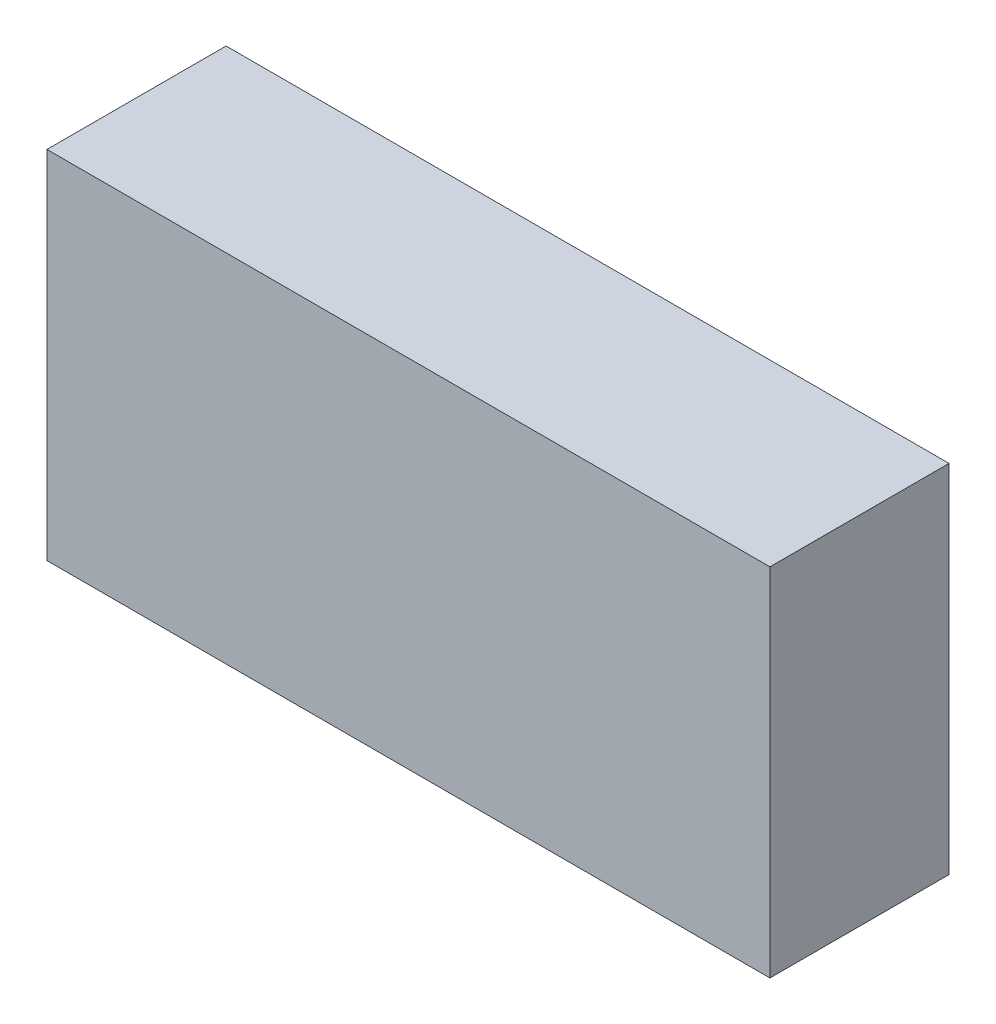
ISO-10303-21;
HEADER;
FILE_DESCRIPTION(('STEP AP214'),'2;1');
FILE_NAME('part.step','',(''),(''),'','','');
FILE_SCHEMA(('AUTOMOTIVE_DESIGN { 1 0 10303 214 1 1 1 1 }'));
ENDSEC;
DATA;
#1=APPLICATION_CONTEXT('core data for automotive mechanical design processes');
#2=APPLICATION_PROTOCOL_DEFINITION('international standard','automotive_design',2000,#1);
#3=PRODUCT_CONTEXT('',#1,'mechanical');
#4=PRODUCT('Part','Part','',(#3));
#5=PRODUCT_RELATED_PRODUCT_CATEGORY('part','',(#4));
#6=PRODUCT_DEFINITION_FORMATION('','',#4);
#7=PRODUCT_DEFINITION_CONTEXT('part definition',#1,'design');
#8=PRODUCT_DEFINITION('design','',#6,#7);
#9=PRODUCT_DEFINITION_SHAPE('','',#8);
#10=(LENGTH_UNIT() NAMED_UNIT(*) SI_UNIT(.MILLI.,.METRE.));
#11=(NAMED_UNIT(*) PLANE_ANGLE_UNIT() SI_UNIT($,.RADIAN.));
#12=(NAMED_UNIT(*) SI_UNIT($,.STERADIAN.) SOLID_ANGLE_UNIT());
#13=UNCERTAINTY_MEASURE_WITH_UNIT(LENGTH_MEASURE(1.E-05),#10,'distance_accuracy_value','');
#14=(GEOMETRIC_REPRESENTATION_CONTEXT(3) GLOBAL_UNCERTAINTY_ASSIGNED_CONTEXT((#13)) GLOBAL_UNIT_ASSIGNED_CONTEXT((#10,
#11,#12)) REPRESENTATION_CONTEXT('',''));
#15=CARTESIAN_POINT('',(0.,0.,0.));
#16=DIRECTION('',(0.,0.,1.));
#17=DIRECTION('',(1.,0.,0.));
#18=AXIS2_PLACEMENT_3D('',#15,#16,#17);
#19=CARTESIAN_POINT('',(0.,0.,21.082));
#20=DIRECTION('',(1.,0.,0.));
#21=DIRECTION('',(0.,0.,-1.));
#22=AXIS2_PLACEMENT_3D('',#19,#20,#21);
#23=PLANE('',#22);
#24=DIRECTION('',(0.,-1.,0.));
#25=VECTOR('',#24,1.);
#26=CARTESIAN_POINT('',(0.,0.,0.));
#27=LINE('',#26,#25);
#28=CARTESIAN_POINT('',(0.,41.91,0.));
#29=VERTEX_POINT('',#28);
#30=CARTESIAN_POINT('',(0.,0.,0.));
#31=VERTEX_POINT('',#30);
#32=EDGE_CURVE('E97',#29,#31,#27,.T.);
#33=ORIENTED_EDGE('',*,*,#32,.T.);
#34=DIRECTION('',(0.,0.,-1.));
#35=VECTOR('',#34,1.);
#36=CARTESIAN_POINT('',(0.,0.,21.082));
#37=LINE('',#36,#35);
#38=CARTESIAN_POINT('',(0.,0.,21.082));
#39=VERTEX_POINT('',#38);
#40=EDGE_CURVE('E11',#39,#31,#37,.T.);
#41=ORIENTED_EDGE('',*,*,#40,.F.);
#42=DIRECTION('',(0.,-1.,0.));
#43=VECTOR('',#42,1.);
#44=CARTESIAN_POINT('',(0.,0.,21.082));
#45=LINE('',#44,#43);
#46=CARTESIAN_POINT('',(0.,41.91,21.082));
#47=VERTEX_POINT('',#46);
#48=EDGE_CURVE('E85',#47,#39,#45,.T.);
#49=ORIENTED_EDGE('',*,*,#48,.F.);
#50=DIRECTION('',(0.,0.,-1.));
#51=VECTOR('',#50,1.);
#52=CARTESIAN_POINT('',(0.,41.91,21.082));
#53=LINE('',#52,#51);
#54=EDGE_CURVE('E93',#47,#29,#53,.T.);
#55=ORIENTED_EDGE('',*,*,#54,.T.);
#56=EDGE_LOOP('',(#33,#41,#49,#55));
#57=FACE_BOUND('',#56,.T.);
#58=ADVANCED_FACE('F34',(#57),#23,.F.);
#59=CARTESIAN_POINT('',(0.,0.,21.082));
#60=DIRECTION('',(0.,1.,0.));
#61=DIRECTION('',(0.,0.,1.));
#62=AXIS2_PLACEMENT_3D('',#59,#60,#61);
#63=PLANE('',#62);
#64=DIRECTION('',(1.,0.,0.));
#65=VECTOR('',#64,1.);
#66=CARTESIAN_POINT('',(0.,0.,0.));
#67=LINE('',#66,#65);
#68=CARTESIAN_POINT('',(85.09,0.,0.));
#69=VERTEX_POINT('',#68);
#70=EDGE_CURVE('E89',#31,#69,#67,.T.);
#71=ORIENTED_EDGE('',*,*,#70,.T.);
#72=DIRECTION('',(0.,0.,-1.));
#73=VECTOR('',#72,1.);
#74=CARTESIAN_POINT('',(85.09,0.,21.082));
#75=LINE('',#74,#73);
#76=CARTESIAN_POINT('',(85.09,0.,21.082));
#77=VERTEX_POINT('',#76);
#78=EDGE_CURVE('E42',#77,#69,#75,.T.);
#79=ORIENTED_EDGE('',*,*,#78,.F.);
#80=DIRECTION('',(1.,0.,0.));
#81=VECTOR('',#80,1.);
#82=CARTESIAN_POINT('',(0.,0.,21.082));
#83=LINE('',#82,#81);
#84=EDGE_CURVE('E80',#39,#77,#83,.T.);
#85=ORIENTED_EDGE('',*,*,#84,.F.);
#86=ORIENTED_EDGE('',*,*,#40,.T.);
#87=EDGE_LOOP('',(#71,#79,#85,#86));
#88=FACE_BOUND('',#87,.T.);
#89=ADVANCED_FACE('F88',(#88),#63,.F.);
#90=CARTESIAN_POINT('',(85.09,0.,21.082));
#91=DIRECTION('',(-1.,0.,0.));
#92=DIRECTION('',(0.,0.,1.));
#93=AXIS2_PLACEMENT_3D('',#90,#91,#92);
#94=PLANE('',#93);
#95=DIRECTION('',(0.,1.,0.));
#96=VECTOR('',#95,1.);
#97=CARTESIAN_POINT('',(85.09,0.,0.));
#98=LINE('',#97,#96);
#99=CARTESIAN_POINT('',(85.09,41.91,0.));
#100=VERTEX_POINT('',#99);
#101=EDGE_CURVE('E67',#69,#100,#98,.T.);
#102=ORIENTED_EDGE('',*,*,#101,.T.);
#103=DIRECTION('',(0.,0.,-1.));
#104=VECTOR('',#103,1.);
#105=CARTESIAN_POINT('',(85.09,41.91,21.082));
#106=LINE('',#105,#104);
#107=CARTESIAN_POINT('',(85.09,41.91,21.082));
#108=VERTEX_POINT('',#107);
#109=EDGE_CURVE('E90',#108,#100,#106,.T.);
#110=ORIENTED_EDGE('',*,*,#109,.F.);
#111=DIRECTION('',(0.,1.,0.));
#112=VECTOR('',#111,1.);
#113=CARTESIAN_POINT('',(85.09,0.,21.082));
#114=LINE('',#113,#112);
#115=EDGE_CURVE('E83',#77,#108,#114,.T.);
#116=ORIENTED_EDGE('',*,*,#115,.F.);
#117=ORIENTED_EDGE('',*,*,#78,.T.);
#118=EDGE_LOOP('',(#102,#110,#116,#117));
#119=FACE_BOUND('',#118,.T.);
#120=ADVANCED_FACE('F91',(#119),#94,.F.);
#121=CARTESIAN_POINT('',(0.,41.91,21.082));
#122=DIRECTION('',(0.,-1.,0.));
#123=DIRECTION('',(0.,0.,-1.));
#124=AXIS2_PLACEMENT_3D('',#121,#122,#123);
#125=PLANE('',#124);
#126=DIRECTION('',(-1.,0.,0.));
#127=VECTOR('',#126,1.);
#128=CARTESIAN_POINT('',(0.,41.91,0.));
#129=LINE('',#128,#127);
#130=EDGE_CURVE('E73',#100,#29,#129,.T.);
#131=ORIENTED_EDGE('',*,*,#130,.T.);
#132=ORIENTED_EDGE('',*,*,#54,.F.);
#133=DIRECTION('',(-1.,0.,0.));
#134=VECTOR('',#133,1.);
#135=CARTESIAN_POINT('',(0.,41.91,21.082));
#136=LINE('',#135,#134);
#137=EDGE_CURVE('E50',#108,#47,#136,.T.);
#138=ORIENTED_EDGE('',*,*,#137,.F.);
#139=ORIENTED_EDGE('',*,*,#109,.T.);
#140=EDGE_LOOP('',(#131,#132,#138,#139));
#141=FACE_BOUND('',#140,.T.);
#142=ADVANCED_FACE('F104',(#141),#125,.F.);
#143=CARTESIAN_POINT('',(0.,0.,21.082));
#144=DIRECTION('',(0.,0.,-1.));
#145=DIRECTION('',(-1.,0.,0.));
#146=AXIS2_PLACEMENT_3D('',#143,#144,#145);
#147=PLANE('',#146);
#148=ORIENTED_EDGE('',*,*,#48,.T.);
#149=ORIENTED_EDGE('',*,*,#84,.T.);
#150=ORIENTED_EDGE('',*,*,#115,.T.);
#151=ORIENTED_EDGE('',*,*,#137,.T.);
#152=EDGE_LOOP('',(#148,#149,#150,#151));
#153=FACE_BOUND('',#152,.T.);
#154=ADVANCED_FACE('F81',(#153),#147,.F.);
#155=CARTESIAN_POINT('',(0.,0.,0.));
#156=DIRECTION('',(0.,0.,-1.));
#157=DIRECTION('',(-1.,0.,0.));
#158=AXIS2_PLACEMENT_3D('',#155,#156,#157);
#159=PLANE('',#158);
#160=ORIENTED_EDGE('',*,*,#32,.F.);
#161=ORIENTED_EDGE('',*,*,#130,.F.);
#162=ORIENTED_EDGE('',*,*,#101,.F.);
#163=ORIENTED_EDGE('',*,*,#70,.F.);
#164=EDGE_LOOP('',(#160,#161,#162,#163));
#165=FACE_BOUND('',#164,.T.);
#166=ADVANCED_FACE('F107',(#165),#159,.T.);
#167=CLOSED_SHELL('',(#58,#89,#120,#142,#154,#166));
#168=MANIFOLD_SOLID_BREP('B2',#167);
#169=ADVANCED_BREP_SHAPE_REPRESENTATION('',(#18,#168),#14);
#170=SHAPE_DEFINITION_REPRESENTATION(#9,#169);
ENDSEC;
END-ISO-10303-21;
